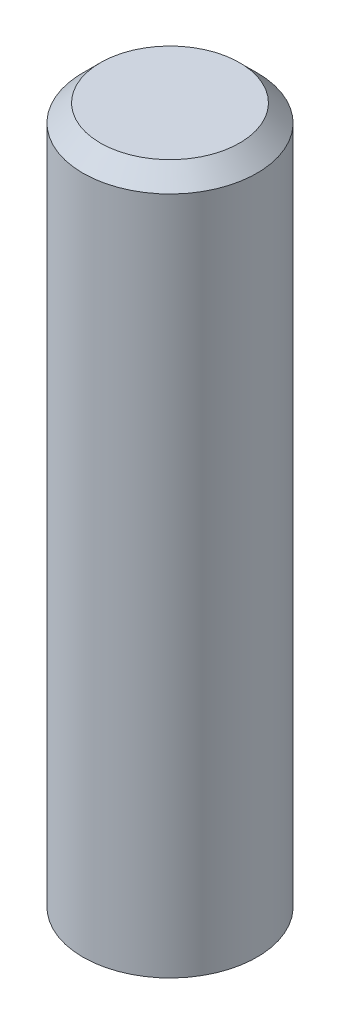
ISO-10303-21;
HEADER;
FILE_DESCRIPTION(('STEP AP214'),'2;1');
FILE_NAME('part.step','',(''),(''),'','','');
FILE_SCHEMA(('AUTOMOTIVE_DESIGN { 1 0 10303 214 1 1 1 1 }'));
ENDSEC;
DATA;
#1=APPLICATION_CONTEXT('core data for automotive mechanical design processes');
#2=APPLICATION_PROTOCOL_DEFINITION('international standard','automotive_design',2000,#1);
#3=PRODUCT_CONTEXT('',#1,'mechanical');
#4=PRODUCT('Part','Part','',(#3));
#5=PRODUCT_RELATED_PRODUCT_CATEGORY('part','',(#4));
#6=PRODUCT_DEFINITION_FORMATION('','',#4);
#7=PRODUCT_DEFINITION_CONTEXT('part definition',#1,'design');
#8=PRODUCT_DEFINITION('design','',#6,#7);
#9=PRODUCT_DEFINITION_SHAPE('','',#8);
#10=(LENGTH_UNIT() NAMED_UNIT(*) SI_UNIT(.MILLI.,.METRE.));
#11=(NAMED_UNIT(*) PLANE_ANGLE_UNIT() SI_UNIT($,.RADIAN.));
#12=(NAMED_UNIT(*) SI_UNIT($,.STERADIAN.) SOLID_ANGLE_UNIT());
#13=UNCERTAINTY_MEASURE_WITH_UNIT(LENGTH_MEASURE(1.E-05),#10,'distance_accuracy_value','');
#14=(GEOMETRIC_REPRESENTATION_CONTEXT(3) GLOBAL_UNCERTAINTY_ASSIGNED_CONTEXT((#13)) GLOBAL_UNIT_ASSIGNED_CONTEXT((#10,
#11,#12)) REPRESENTATION_CONTEXT('',''));
#15=CARTESIAN_POINT('',(0.,0.,0.));
#16=DIRECTION('',(0.,0.,1.));
#17=DIRECTION('',(1.,0.,0.));
#18=AXIS2_PLACEMENT_3D('',#15,#16,#17);
#19=CARTESIAN_POINT('',(0.,2.,0.));
#20=DIRECTION('',(0.,-1.,0.));
#21=DIRECTION('',(0.,0.,-1.));
#22=AXIS2_PLACEMENT_3D('',#19,#20,#21);
#23=CYLINDRICAL_SURFACE('',#22,0.5);
#24=CARTESIAN_POINT('',(0.,1.9,0.));
#25=DIRECTION('',(0.,1.,0.));
#26=DIRECTION('',(0.,0.,1.));
#27=AXIS2_PLACEMENT_3D('',#24,#25,#26);
#28=CIRCLE('',#27,0.5);
#29=CARTESIAN_POINT('',(0.,1.9,0.5));
#30=VERTEX_POINT('',#29);
#31=EDGE_CURVE('E10',#30,#30,#28,.F.);
#32=ORIENTED_EDGE('',*,*,#31,.T.);
#33=EDGE_LOOP('',(#32));
#34=FACE_BOUND('',#33,.T.);
#35=CARTESIAN_POINT('',(0.,-2.,0.));
#36=DIRECTION('',(0.,1.,0.));
#37=DIRECTION('',(0.,0.,1.));
#38=AXIS2_PLACEMENT_3D('',#35,#36,#37);
#39=CIRCLE('',#38,0.5);
#40=CARTESIAN_POINT('',(0.,-2.,0.5));
#41=VERTEX_POINT('',#40);
#42=EDGE_CURVE('E42',#41,#41,#39,.T.);
#43=ORIENTED_EDGE('',*,*,#42,.T.);
#44=EDGE_LOOP('',(#43));
#45=FACE_BOUND('',#44,.T.);
#46=ADVANCED_FACE('F31',(#34,#45),#23,.T.);
#47=CARTESIAN_POINT('',(0.,2.,0.));
#48=DIRECTION('',(0.,1.,0.));
#49=DIRECTION('',(0.,0.,1.));
#50=AXIS2_PLACEMENT_3D('',#47,#48,#49);
#51=PLANE('',#50);
#52=CARTESIAN_POINT('',(0.,2.,0.));
#53=DIRECTION('',(0.,1.,0.));
#54=DIRECTION('',(0.,0.,1.));
#55=AXIS2_PLACEMENT_3D('',#52,#53,#54);
#56=CIRCLE('',#55,0.4);
#57=CARTESIAN_POINT('',(0.,2.,0.4));
#58=VERTEX_POINT('',#57);
#59=EDGE_CURVE('E38',#58,#58,#56,.T.);
#60=ORIENTED_EDGE('',*,*,#59,.T.);
#61=EDGE_LOOP('',(#60));
#62=FACE_BOUND('',#61,.T.);
#63=ADVANCED_FACE('F52',(#62),#51,.T.);
#64=CARTESIAN_POINT('',(0.,-2.,0.));
#65=DIRECTION('',(0.,1.,0.));
#66=DIRECTION('',(0.,0.,1.));
#67=AXIS2_PLACEMENT_3D('',#64,#65,#66);
#68=PLANE('',#67);
#69=ORIENTED_EDGE('',*,*,#42,.F.);
#70=EDGE_LOOP('',(#69));
#71=FACE_BOUND('',#70,.T.);
#72=ADVANCED_FACE('F50',(#71),#68,.F.);
#73=CARTESIAN_POINT('',(0.,2.,0.));
#74=DIRECTION('',(0.,-1.,0.));
#75=DIRECTION('',(0.,0.,-1.));
#76=AXIS2_PLACEMENT_3D('',#73,#74,#75);
#77=CONICAL_SURFACE('',#76,0.4,0.785398163397451);
#78=ORIENTED_EDGE('',*,*,#31,.F.);
#79=EDGE_LOOP('',(#78));
#80=FACE_BOUND('',#79,.T.);
#81=ORIENTED_EDGE('',*,*,#59,.F.);
#82=EDGE_LOOP('',(#81));
#83=FACE_BOUND('',#82,.T.);
#84=ADVANCED_FACE('F33',(#80,#83),#77,.T.);
#85=CLOSED_SHELL('',(#46,#63,#72,#84));
#86=MANIFOLD_SOLID_BREP('B2',#85);
#87=ADVANCED_BREP_SHAPE_REPRESENTATION('',(#18,#86),#14);
#88=SHAPE_DEFINITION_REPRESENTATION(#9,#87);
ENDSEC;
END-ISO-10303-21;
